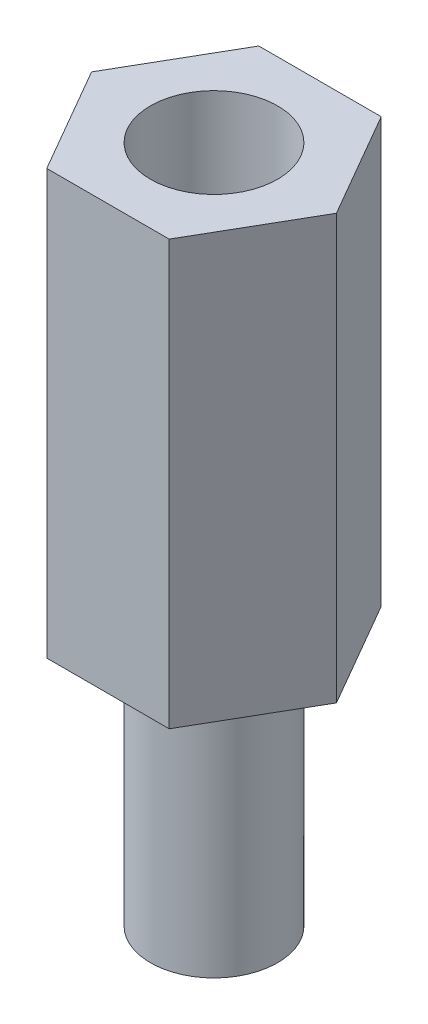
ISO-10303-21;
HEADER;
FILE_DESCRIPTION(('STEP AP214'),'2;1');
FILE_NAME('part.step','',(''),(''),'','','');
FILE_SCHEMA(('AUTOMOTIVE_DESIGN { 1 0 10303 214 1 1 1 1 }'));
ENDSEC;
DATA;
#1=APPLICATION_CONTEXT('core data for automotive mechanical design processes');
#2=APPLICATION_PROTOCOL_DEFINITION('international standard','automotive_design',2000,#1);
#3=PRODUCT_CONTEXT('',#1,'mechanical');
#4=PRODUCT('Part','Part','',(#3));
#5=PRODUCT_RELATED_PRODUCT_CATEGORY('part','',(#4));
#6=PRODUCT_DEFINITION_FORMATION('','',#4);
#7=PRODUCT_DEFINITION_CONTEXT('part definition',#1,'design');
#8=PRODUCT_DEFINITION('design','',#6,#7);
#9=PRODUCT_DEFINITION_SHAPE('','',#8);
#10=(LENGTH_UNIT() NAMED_UNIT(*) SI_UNIT(.MILLI.,.METRE.));
#11=(NAMED_UNIT(*) PLANE_ANGLE_UNIT() SI_UNIT($,.RADIAN.));
#12=(NAMED_UNIT(*) SI_UNIT($,.STERADIAN.) SOLID_ANGLE_UNIT());
#13=UNCERTAINTY_MEASURE_WITH_UNIT(LENGTH_MEASURE(1.E-05),#10,'distance_accuracy_value','');
#14=(GEOMETRIC_REPRESENTATION_CONTEXT(3) GLOBAL_UNCERTAINTY_ASSIGNED_CONTEXT((#13)) GLOBAL_UNIT_ASSIGNED_CONTEXT((#10,
#11,#12)) REPRESENTATION_CONTEXT('',''));
#15=CARTESIAN_POINT('',(0.,0.,0.));
#16=DIRECTION('',(0.,0.,1.));
#17=DIRECTION('',(1.,0.,0.));
#18=AXIS2_PLACEMENT_3D('',#15,#16,#17);
#19=CARTESIAN_POINT('',(0.,-6.,0.));
#20=DIRECTION('',(0.,1.,0.));
#21=DIRECTION('',(0.,0.,1.));
#22=AXIS2_PLACEMENT_3D('',#19,#20,#21);
#23=CYLINDRICAL_SURFACE('',#22,1.5);
#24=CARTESIAN_POINT('',(0.,-6.,0.));
#25=DIRECTION('',(0.,-1.,0.));
#26=DIRECTION('',(0.,0.,-1.));
#27=AXIS2_PLACEMENT_3D('',#24,#25,#26);
#28=CIRCLE('',#27,1.5);
#29=CARTESIAN_POINT('',(0.,-6.,-1.5));
#30=VERTEX_POINT('',#29);
#31=EDGE_CURVE('E11',#30,#30,#28,.T.);
#32=ORIENTED_EDGE('',*,*,#31,.F.);
#33=EDGE_LOOP('',(#32));
#34=FACE_BOUND('',#33,.T.);
#35=CARTESIAN_POINT('',(0.,0.,0.));
#36=DIRECTION('',(0.,-1.,0.));
#37=DIRECTION('',(0.,0.,-1.));
#38=AXIS2_PLACEMENT_3D('',#35,#36,#37);
#39=CIRCLE('',#38,1.5);
#40=CARTESIAN_POINT('',(0.,0.,-1.5));
#41=VERTEX_POINT('',#40);
#42=EDGE_CURVE('E43',#41,#41,#39,.T.);
#43=ORIENTED_EDGE('',*,*,#42,.T.);
#44=EDGE_LOOP('',(#43));
#45=FACE_BOUND('',#44,.T.);
#46=ADVANCED_FACE('F40',(#34,#45),#23,.T.);
#47=CARTESIAN_POINT('',(0.,-6.,0.));
#48=DIRECTION('',(0.,-1.,0.));
#49=DIRECTION('',(0.,0.,-1.));
#50=AXIS2_PLACEMENT_3D('',#47,#48,#49);
#51=PLANE('',#50);
#52=ORIENTED_EDGE('',*,*,#31,.T.);
#53=EDGE_LOOP('',(#52));
#54=FACE_BOUND('',#53,.T.);
#55=ADVANCED_FACE('F55',(#54),#51,.T.);
#56=CARTESIAN_POINT('',(0.,0.,0.));
#57=DIRECTION('',(0.,-1.,0.));
#58=DIRECTION('',(0.,0.,-1.));
#59=AXIS2_PLACEMENT_3D('',#56,#57,#58);
#60=PLANE('',#59);
#61=ORIENTED_EDGE('',*,*,#42,.F.);
#62=EDGE_LOOP('',(#61));
#63=FACE_BOUND('',#62,.T.);
#64=ADVANCED_FACE('F53',(#63),#60,.F.);
#65=CLOSED_SHELL('',(#46,#55,#64));
#66=MANIFOLD_SOLID_BREP('B2',#65);
#67=CARTESIAN_POINT('',(0.,10.,0.));
#68=DIRECTION('',(0.,1.,0.));
#69=DIRECTION('',(0.,0.,1.));
#70=AXIS2_PLACEMENT_3D('',#67,#68,#69);
#71=PLANE('',#70);
#72=DIRECTION('',(1.,0.,0.));
#73=VECTOR('',#72,1.);
#74=CARTESIAN_POINT('',(-1.44337567297405,10.,2.5));
#75=LINE('',#74,#73);
#76=CARTESIAN_POINT('',(-1.44337567297405,10.,2.5));
#77=VERTEX_POINT('',#76);
#78=CARTESIAN_POINT('',(1.44337567297408,10.,2.5));
#79=VERTEX_POINT('',#78);
#80=EDGE_CURVE('E176',#77,#79,#75,.T.);
#81=ORIENTED_EDGE('',*,*,#80,.T.);
#82=DIRECTION('',(0.500000000000001,0.,-0.866025403784438));
#83=VECTOR('',#82,1.);
#84=CARTESIAN_POINT('',(1.44337567297408,10.,2.5));
#85=LINE('',#84,#83);
#86=CARTESIAN_POINT('',(2.88675134594815,10.,0.));
#87=VERTEX_POINT('',#86);
#88=EDGE_CURVE('E134',#79,#87,#85,.T.);
#89=ORIENTED_EDGE('',*,*,#88,.T.);
#90=DIRECTION('',(-0.500000000000001,0.,-0.866025403784438));
#91=VECTOR('',#90,1.);
#92=CARTESIAN_POINT('',(2.88675134594815,10.,0.));
#93=LINE('',#92,#91);
#94=CARTESIAN_POINT('',(1.44337567297408,10.,-2.50000000000001));
#95=VERTEX_POINT('',#94);
#96=EDGE_CURVE('E147',#87,#95,#93,.T.);
#97=ORIENTED_EDGE('',*,*,#96,.T.);
#98=DIRECTION('',(-1.,0.,0.));
#99=VECTOR('',#98,1.);
#100=CARTESIAN_POINT('',(1.44337567297408,10.,-2.50000000000001));
#101=LINE('',#100,#99);
#102=CARTESIAN_POINT('',(-1.44337567297405,10.,-2.50000000000001));
#103=VERTEX_POINT('',#102);
#104=EDGE_CURVE('E141',#95,#103,#101,.T.);
#105=ORIENTED_EDGE('',*,*,#104,.T.);
#106=DIRECTION('',(-0.5,0.,0.866025403784438));
#107=VECTOR('',#106,1.);
#108=CARTESIAN_POINT('',(-1.44337567297405,10.,-2.50000000000001));
#109=LINE('',#108,#107);
#110=CARTESIAN_POINT('',(-2.88675134594812,10.,0.));
#111=VERTEX_POINT('',#110);
#112=EDGE_CURVE('E145',#103,#111,#109,.T.);
#113=ORIENTED_EDGE('',*,*,#112,.T.);
#114=DIRECTION('',(0.5,0.,0.866025403784438));
#115=VECTOR('',#114,1.);
#116=CARTESIAN_POINT('',(-2.88675134594812,10.,0.));
#117=LINE('',#116,#115);
#118=EDGE_CURVE('E97',#111,#77,#117,.T.);
#119=ORIENTED_EDGE('',*,*,#118,.T.);
#120=EDGE_LOOP('',(#81,#89,#97,#105,#113,#119));
#121=FACE_BOUND('',#120,.T.);
#122=CARTESIAN_POINT('',(0.,10.,0.));
#123=DIRECTION('',(0.,1.,0.));
#124=DIRECTION('',(0.,0.,1.));
#125=AXIS2_PLACEMENT_3D('',#122,#123,#124);
#126=CIRCLE('',#125,1.5);
#127=CARTESIAN_POINT('',(0.,10.,1.5));
#128=VERTEX_POINT('',#127);
#129=EDGE_CURVE('E169',#128,#128,#126,.T.);
#130=ORIENTED_EDGE('',*,*,#129,.F.);
#131=EDGE_LOOP('',(#130));
#132=FACE_BOUND('',#131,.T.);
#133=ADVANCED_FACE('F80',(#121,#132),#71,.T.);
#134=CARTESIAN_POINT('',(0.,0.,0.));
#135=DIRECTION('',(0.,1.,0.));
#136=DIRECTION('',(0.,0.,1.));
#137=AXIS2_PLACEMENT_3D('',#134,#135,#136);
#138=PLANE('',#137);
#139=DIRECTION('',(1.,0.,0.));
#140=VECTOR('',#139,1.);
#141=CARTESIAN_POINT('',(-1.44337567297405,0.,2.5));
#142=LINE('',#141,#140);
#143=CARTESIAN_POINT('',(-1.44337567297405,0.,2.5));
#144=VERTEX_POINT('',#143);
#145=CARTESIAN_POINT('',(1.44337567297408,0.,2.5));
#146=VERTEX_POINT('',#145);
#147=EDGE_CURVE('E165',#144,#146,#142,.T.);
#148=ORIENTED_EDGE('',*,*,#147,.F.);
#149=DIRECTION('',(0.5,0.,0.866025403784438));
#150=VECTOR('',#149,1.);
#151=CARTESIAN_POINT('',(-2.88675134594812,0.,0.));
#152=LINE('',#151,#150);
#153=CARTESIAN_POINT('',(-2.88675134594812,0.,0.));
#154=VERTEX_POINT('',#153);
#155=EDGE_CURVE('E126',#154,#144,#152,.T.);
#156=ORIENTED_EDGE('',*,*,#155,.F.);
#157=DIRECTION('',(-0.5,0.,0.866025403784438));
#158=VECTOR('',#157,1.);
#159=CARTESIAN_POINT('',(-1.44337567297405,0.,-2.50000000000001));
#160=LINE('',#159,#158);
#161=CARTESIAN_POINT('',(-1.44337567297405,0.,-2.50000000000001));
#162=VERTEX_POINT('',#161);
#163=EDGE_CURVE('E120',#162,#154,#160,.T.);
#164=ORIENTED_EDGE('',*,*,#163,.F.);
#165=DIRECTION('',(-1.,0.,0.));
#166=VECTOR('',#165,1.);
#167=CARTESIAN_POINT('',(1.44337567297408,0.,-2.50000000000001));
#168=LINE('',#167,#166);
#169=CARTESIAN_POINT('',(1.44337567297408,0.,-2.50000000000001));
#170=VERTEX_POINT('',#169);
#171=EDGE_CURVE('E155',#170,#162,#168,.T.);
#172=ORIENTED_EDGE('',*,*,#171,.F.);
#173=DIRECTION('',(-0.500000000000001,0.,-0.866025403784438));
#174=VECTOR('',#173,1.);
#175=CARTESIAN_POINT('',(2.88675134594815,0.,0.));
#176=LINE('',#175,#174);
#177=CARTESIAN_POINT('',(2.88675134594815,0.,0.));
#178=VERTEX_POINT('',#177);
#179=EDGE_CURVE('E171',#178,#170,#176,.T.);
#180=ORIENTED_EDGE('',*,*,#179,.F.);
#181=DIRECTION('',(0.500000000000001,0.,-0.866025403784438));
#182=VECTOR('',#181,1.);
#183=CARTESIAN_POINT('',(1.44337567297408,0.,2.5));
#184=LINE('',#183,#182);
#185=EDGE_CURVE('E168',#146,#178,#184,.T.);
#186=ORIENTED_EDGE('',*,*,#185,.F.);
#187=EDGE_LOOP('',(#148,#156,#164,#172,#180,#186));
#188=FACE_BOUND('',#187,.T.);
#189=CARTESIAN_POINT('',(0.,0.,0.));
#190=DIRECTION('',(0.,1.,0.));
#191=DIRECTION('',(0.,0.,1.));
#192=AXIS2_PLACEMENT_3D('',#189,#190,#191);
#193=CIRCLE('',#192,1.5);
#194=CARTESIAN_POINT('',(0.,0.,1.5));
#195=VERTEX_POINT('',#194);
#196=EDGE_CURVE('E269',#195,#195,#193,.T.);
#197=ORIENTED_EDGE('',*,*,#196,.T.);
#198=EDGE_LOOP('',(#197));
#199=FACE_BOUND('',#198,.T.);
#200=ADVANCED_FACE('F185',(#188,#199),#138,.F.);
#201=CARTESIAN_POINT('',(-1.44337567297405,10.,2.5));
#202=DIRECTION('',(0.,0.,-1.));
#203=DIRECTION('',(-1.,0.,0.));
#204=AXIS2_PLACEMENT_3D('',#201,#202,#203);
#205=PLANE('',#204);
#206=ORIENTED_EDGE('',*,*,#147,.T.);
#207=DIRECTION('',(0.,-1.,0.));
#208=VECTOR('',#207,1.);
#209=CARTESIAN_POINT('',(1.44337567297408,10.,2.5));
#210=LINE('',#209,#208);
#211=EDGE_CURVE('E38',#79,#146,#210,.T.);
#212=ORIENTED_EDGE('',*,*,#211,.F.);
#213=ORIENTED_EDGE('',*,*,#80,.F.);
#214=DIRECTION('',(0.,-1.,0.));
#215=VECTOR('',#214,1.);
#216=CARTESIAN_POINT('',(-1.44337567297405,10.,2.5));
#217=LINE('',#216,#215);
#218=EDGE_CURVE('E161',#77,#144,#217,.T.);
#219=ORIENTED_EDGE('',*,*,#218,.T.);
#220=EDGE_LOOP('',(#206,#212,#213,#219));
#221=FACE_BOUND('',#220,.T.);
#222=ADVANCED_FACE('F82',(#221),#205,.F.);
#223=CARTESIAN_POINT('',(1.44337567297408,10.,2.5));
#224=DIRECTION('',(-0.866025403784438,0.,-0.500000000000001));
#225=DIRECTION('',(-0.500000000000001,0.,0.866025403784438));
#226=AXIS2_PLACEMENT_3D('',#223,#224,#225);
#227=PLANE('',#226);
#228=ORIENTED_EDGE('',*,*,#185,.T.);
#229=DIRECTION('',(0.,-1.,0.));
#230=VECTOR('',#229,1.);
#231=CARTESIAN_POINT('',(2.88675134594815,10.,0.));
#232=LINE('',#231,#230);
#233=EDGE_CURVE('E89',#87,#178,#232,.T.);
#234=ORIENTED_EDGE('',*,*,#233,.F.);
#235=ORIENTED_EDGE('',*,*,#88,.F.);
#236=ORIENTED_EDGE('',*,*,#211,.T.);
#237=EDGE_LOOP('',(#228,#234,#235,#236));
#238=FACE_BOUND('',#237,.T.);
#239=ADVANCED_FACE('F210',(#238),#227,.F.);
#240=CARTESIAN_POINT('',(2.88675134594815,10.,0.));
#241=DIRECTION('',(-0.866025403784438,0.,0.500000000000001));
#242=DIRECTION('',(0.500000000000001,0.,0.866025403784438));
#243=AXIS2_PLACEMENT_3D('',#240,#241,#242);
#244=PLANE('',#243);
#245=ORIENTED_EDGE('',*,*,#179,.T.);
#246=DIRECTION('',(0.,-1.,0.));
#247=VECTOR('',#246,1.);
#248=CARTESIAN_POINT('',(1.44337567297408,10.,-2.50000000000001));
#249=LINE('',#248,#247);
#250=EDGE_CURVE('E156',#95,#170,#249,.T.);
#251=ORIENTED_EDGE('',*,*,#250,.F.);
#252=ORIENTED_EDGE('',*,*,#96,.F.);
#253=ORIENTED_EDGE('',*,*,#233,.T.);
#254=EDGE_LOOP('',(#245,#251,#252,#253));
#255=FACE_BOUND('',#254,.T.);
#256=ADVANCED_FACE('F182',(#255),#244,.F.);
#257=CARTESIAN_POINT('',(1.44337567297408,10.,-2.50000000000001));
#258=DIRECTION('',(0.,0.,1.));
#259=DIRECTION('',(1.,0.,0.));
#260=AXIS2_PLACEMENT_3D('',#257,#258,#259);
#261=PLANE('',#260);
#262=ORIENTED_EDGE('',*,*,#171,.T.);
#263=DIRECTION('',(0.,-1.,0.));
#264=VECTOR('',#263,1.);
#265=CARTESIAN_POINT('',(-1.44337567297405,10.,-2.50000000000001));
#266=LINE('',#265,#264);
#267=EDGE_CURVE('E152',#103,#162,#266,.T.);
#268=ORIENTED_EDGE('',*,*,#267,.F.);
#269=ORIENTED_EDGE('',*,*,#104,.F.);
#270=ORIENTED_EDGE('',*,*,#250,.T.);
#271=EDGE_LOOP('',(#262,#268,#269,#270));
#272=FACE_BOUND('',#271,.T.);
#273=ADVANCED_FACE('F153',(#272),#261,.F.);
#274=CARTESIAN_POINT('',(-1.44337567297405,10.,-2.50000000000001));
#275=DIRECTION('',(0.866025403784439,0.,0.5));
#276=DIRECTION('',(0.5,0.,-0.866025403784439));
#277=AXIS2_PLACEMENT_3D('',#274,#275,#276);
#278=PLANE('',#277);
#279=ORIENTED_EDGE('',*,*,#163,.T.);
#280=DIRECTION('',(0.,-1.,0.));
#281=VECTOR('',#280,1.);
#282=CARTESIAN_POINT('',(-2.88675134594812,10.,0.));
#283=LINE('',#282,#281);
#284=EDGE_CURVE('E157',#111,#154,#283,.T.);
#285=ORIENTED_EDGE('',*,*,#284,.F.);
#286=ORIENTED_EDGE('',*,*,#112,.F.);
#287=ORIENTED_EDGE('',*,*,#267,.T.);
#288=EDGE_LOOP('',(#279,#285,#286,#287));
#289=FACE_BOUND('',#288,.T.);
#290=ADVANCED_FACE('F159',(#289),#278,.F.);
#291=CARTESIAN_POINT('',(-2.88675134594812,10.,0.));
#292=DIRECTION('',(0.866025403784438,0.,-0.5));
#293=DIRECTION('',(-0.5,0.,-0.866025403784438));
#294=AXIS2_PLACEMENT_3D('',#291,#292,#293);
#295=PLANE('',#294);
#296=ORIENTED_EDGE('',*,*,#155,.T.);
#297=ORIENTED_EDGE('',*,*,#218,.F.);
#298=ORIENTED_EDGE('',*,*,#118,.F.);
#299=ORIENTED_EDGE('',*,*,#284,.T.);
#300=EDGE_LOOP('',(#296,#297,#298,#299));
#301=FACE_BOUND('',#300,.T.);
#302=ADVANCED_FACE('F190',(#301),#295,.F.);
#303=CARTESIAN_POINT('',(0.,10.,0.));
#304=DIRECTION('',(0.,-1.,0.));
#305=DIRECTION('',(0.,0.,-1.));
#306=AXIS2_PLACEMENT_3D('',#303,#304,#305);
#307=CYLINDRICAL_SURFACE('',#306,1.5);
#308=ORIENTED_EDGE('',*,*,#129,.T.);
#309=EDGE_LOOP('',(#308));
#310=FACE_BOUND('',#309,.T.);
#311=ORIENTED_EDGE('',*,*,#196,.F.);
#312=EDGE_LOOP('',(#311));
#313=FACE_BOUND('',#312,.T.);
#314=ADVANCED_FACE('F192',(#310,#313),#307,.F.);
#315=CLOSED_SHELL('',(#133,#200,#222,#239,#256,#273,#290,#302,#314));
#316=MANIFOLD_SOLID_BREP('B6',#315);
#317=ADVANCED_BREP_SHAPE_REPRESENTATION('',(#18,#66,#316),#14);
#318=SHAPE_DEFINITION_REPRESENTATION(#9,#317);
ENDSEC;
END-ISO-10303-21;
